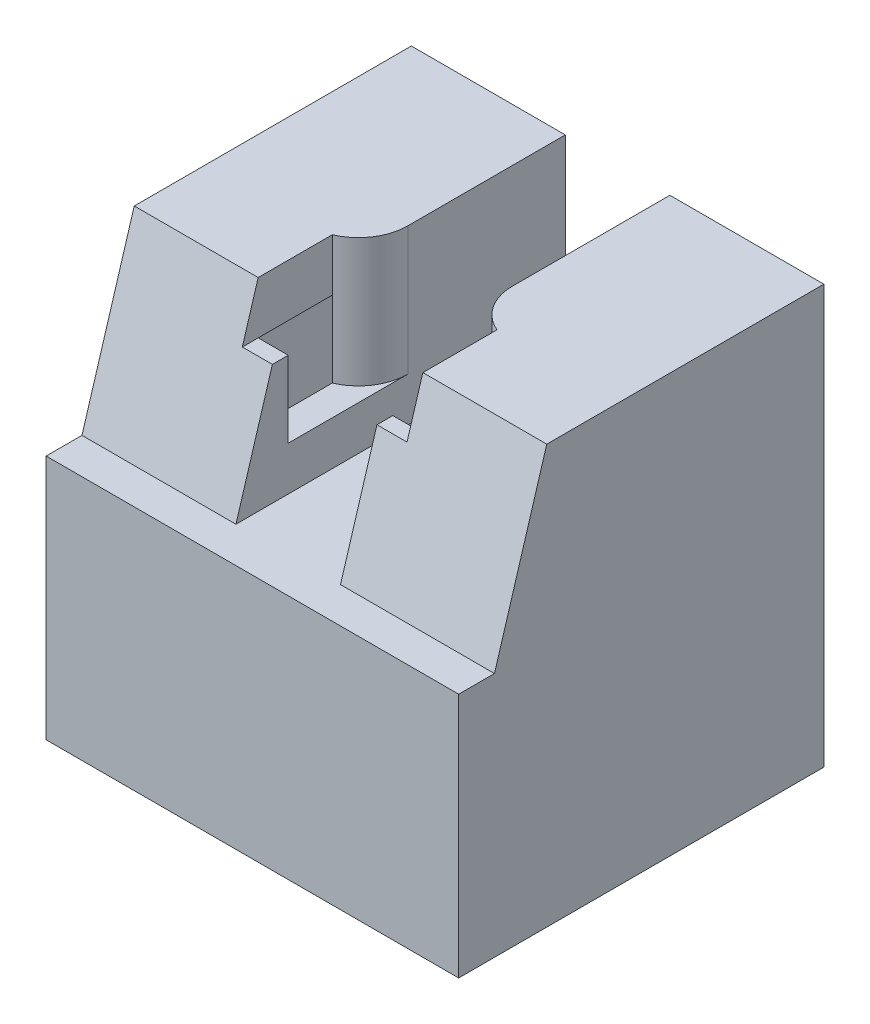
ISO-10303-21;
HEADER;
FILE_DESCRIPTION(('STEP AP214'),'2;1');
FILE_NAME('part.step','',(''),(''),'','','');
FILE_SCHEMA(('AUTOMOTIVE_DESIGN { 1 0 10303 214 1 1 1 1 }'));
ENDSEC;
DATA;
#1=APPLICATION_CONTEXT('core data for automotive mechanical design processes');
#2=APPLICATION_PROTOCOL_DEFINITION('international standard','automotive_design',2000,#1);
#3=PRODUCT_CONTEXT('',#1,'mechanical');
#4=PRODUCT('Part','Part','',(#3));
#5=PRODUCT_RELATED_PRODUCT_CATEGORY('part','',(#4));
#6=PRODUCT_DEFINITION_FORMATION('','',#4);
#7=PRODUCT_DEFINITION_CONTEXT('part definition',#1,'design');
#8=PRODUCT_DEFINITION('design','',#6,#7);
#9=PRODUCT_DEFINITION_SHAPE('','',#8);
#10=(LENGTH_UNIT() NAMED_UNIT(*) SI_UNIT(.MILLI.,.METRE.));
#11=(NAMED_UNIT(*) PLANE_ANGLE_UNIT() SI_UNIT($,.RADIAN.));
#12=(NAMED_UNIT(*) SI_UNIT($,.STERADIAN.) SOLID_ANGLE_UNIT());
#13=UNCERTAINTY_MEASURE_WITH_UNIT(LENGTH_MEASURE(1.E-05),#10,'distance_accuracy_value','');
#14=(GEOMETRIC_REPRESENTATION_CONTEXT(3) GLOBAL_UNCERTAINTY_ASSIGNED_CONTEXT((#13)) GLOBAL_UNIT_ASSIGNED_CONTEXT((#10,
#11,#12)) REPRESENTATION_CONTEXT('',''));
#15=CARTESIAN_POINT('',(0.,0.,0.));
#16=DIRECTION('',(0.,0.,1.));
#17=DIRECTION('',(1.,0.,0.));
#18=AXIS2_PLACEMENT_3D('',#15,#16,#17);
#19=CARTESIAN_POINT('',(-3.175,0.,10.));
#20=DIRECTION('',(1.,0.,0.));
#21=DIRECTION('',(0.,1.,0.));
#22=AXIS2_PLACEMENT_3D('',#19,#20,#21);
#23=PLANE('',#22);
#24=DIRECTION('',(0.,0.,-1.));
#25=VECTOR('',#24,1.);
#26=CARTESIAN_POINT('',(-3.175,25.4,10.));
#27=LINE('',#26,#25);
#28=CARTESIAN_POINT('',(-3.175,25.4,-0.435321539241397));
#29=VERTEX_POINT('',#28);
#30=CARTESIAN_POINT('',(-3.175,25.4,-10.));
#31=VERTEX_POINT('',#30);
#32=EDGE_CURVE('E431',#29,#31,#27,.T.);
#33=ORIENTED_EDGE('',*,*,#32,.F.);
#34=DIRECTION('',(0.,-1.,0.));
#35=VECTOR('',#34,1.);
#36=CARTESIAN_POINT('',(-3.175,17.6,-0.435321539241397));
#37=LINE('',#36,#35);
#38=CARTESIAN_POINT('',(-3.175,17.6,-0.435321539241397));
#39=VERTEX_POINT('',#38);
#40=EDGE_CURVE('E457',#29,#39,#37,.T.);
#41=ORIENTED_EDGE('',*,*,#40,.T.);
#42=DIRECTION('',(0.,0.,-1.));
#43=VECTOR('',#42,1.);
#44=CARTESIAN_POINT('',(-3.175,17.6,14.8356569643195));
#45=LINE('',#44,#43);
#46=CARTESIAN_POINT('',(-3.175,17.6,6.825));
#47=VERTEX_POINT('',#46);
#48=EDGE_CURVE('E47',#47,#39,#45,.T.);
#49=ORIENTED_EDGE('',*,*,#48,.F.);
#50=DIRECTION('',(0.,1.,0.));
#51=VECTOR('',#50,1.);
#52=CARTESIAN_POINT('',(-3.175,25.4,6.825));
#53=LINE('',#52,#51);
#54=CARTESIAN_POINT('',(-3.175,22.225,6.825));
#55=VERTEX_POINT('',#54);
#56=EDGE_CURVE('E282',#47,#55,#53,.T.);
#57=ORIENTED_EDGE('',*,*,#56,.T.);
#58=DIRECTION('',(0.,0.,1.));
#59=VECTOR('',#58,1.);
#60=CARTESIAN_POINT('',(-3.175,22.225,10.));
#61=LINE('',#60,#59);
#62=CARTESIAN_POINT('',(-3.175,22.225,7.7873508353222));
#63=VERTEX_POINT('',#62);
#64=EDGE_CURVE('E560',#55,#63,#61,.T.);
#65=ORIENTED_EDGE('',*,*,#64,.T.);
#66=DIRECTION('',(0.,-0.957005192729791,0.290070786340534));
#67=VECTOR('',#66,1.);
#68=CARTESIAN_POINT('',(-3.175,1.25580533674162,14.1431687881475));
#69=LINE('',#68,#67);
#70=CARTESIAN_POINT('',(-3.175,14.925,10.));
#71=VERTEX_POINT('',#70);
#72=EDGE_CURVE('E567',#63,#71,#69,.T.);
#73=ORIENTED_EDGE('',*,*,#72,.T.);
#74=DIRECTION('',(0.,0.,-1.));
#75=VECTOR('',#74,1.);
#76=CARTESIAN_POINT('',(-3.175,14.925,10.));
#77=LINE('',#76,#75);
#78=CARTESIAN_POINT('',(-3.175,14.925,-10.));
#79=VERTEX_POINT('',#78);
#80=EDGE_CURVE('E432',#71,#79,#77,.T.);
#81=ORIENTED_EDGE('',*,*,#80,.T.);
#82=DIRECTION('',(0.,-1.,0.));
#83=VECTOR('',#82,1.);
#84=CARTESIAN_POINT('',(-3.175,0.,-10.));
#85=LINE('',#84,#83);
#86=EDGE_CURVE('E421',#31,#79,#85,.T.);
#87=ORIENTED_EDGE('',*,*,#86,.F.);
#88=EDGE_LOOP('',(#33,#41,#49,#57,#65,#73,#81,#87));
#89=FACE_BOUND('',#88,.T.);
#90=ADVANCED_FACE('F33',(#89),#23,.T.);
#91=CARTESIAN_POINT('',(3.175,0.,10.));
#92=DIRECTION('',(1.,0.,0.));
#93=DIRECTION('',(0.,1.,0.));
#94=AXIS2_PLACEMENT_3D('',#91,#92,#93);
#95=PLANE('',#94);
#96=DIRECTION('',(0.,0.,-1.));
#97=VECTOR('',#96,1.);
#98=CARTESIAN_POINT('',(3.175,17.6,14.8356569643195));
#99=LINE('',#98,#97);
#100=CARTESIAN_POINT('',(3.175,17.6,6.825));
#101=VERTEX_POINT('',#100);
#102=CARTESIAN_POINT('',(3.175,17.6,-0.435321539241397));
#103=VERTEX_POINT('',#102);
#104=EDGE_CURVE('E270',#101,#103,#99,.T.);
#105=ORIENTED_EDGE('',*,*,#104,.T.);
#106=DIRECTION('',(0.,-1.,0.));
#107=VECTOR('',#106,1.);
#108=CARTESIAN_POINT('',(3.175,0.,-0.435321539241397));
#109=LINE('',#108,#107);
#110=CARTESIAN_POINT('',(3.175,25.4,-0.435321539241397));
#111=VERTEX_POINT('',#110);
#112=EDGE_CURVE('E253',#103,#111,#109,.F.);
#113=ORIENTED_EDGE('',*,*,#112,.T.);
#114=DIRECTION('',(0.,0.,-1.));
#115=VECTOR('',#114,1.);
#116=CARTESIAN_POINT('',(3.175,25.4,10.));
#117=LINE('',#116,#115);
#118=CARTESIAN_POINT('',(3.175,25.4,-10.));
#119=VERTEX_POINT('',#118);
#120=EDGE_CURVE('E437',#111,#119,#117,.T.);
#121=ORIENTED_EDGE('',*,*,#120,.T.);
#122=DIRECTION('',(0.,-1.,0.));
#123=VECTOR('',#122,1.);
#124=CARTESIAN_POINT('',(3.175,0.,-10.));
#125=LINE('',#124,#123);
#126=CARTESIAN_POINT('',(3.175,14.925,-10.));
#127=VERTEX_POINT('',#126);
#128=EDGE_CURVE('E425',#119,#127,#125,.T.);
#129=ORIENTED_EDGE('',*,*,#128,.T.);
#130=DIRECTION('',(0.,0.,-1.));
#131=VECTOR('',#130,1.);
#132=CARTESIAN_POINT('',(3.175,14.925,10.));
#133=LINE('',#132,#131);
#134=CARTESIAN_POINT('',(3.175,14.925,10.));
#135=VERTEX_POINT('',#134);
#136=EDGE_CURVE('E435',#135,#127,#133,.T.);
#137=ORIENTED_EDGE('',*,*,#136,.F.);
#138=DIRECTION('',(0.,-0.957005192729791,0.290070786340534));
#139=VECTOR('',#138,1.);
#140=CARTESIAN_POINT('',(3.175,1.25580533674162,14.1431687881475));
#141=LINE('',#140,#139);
#142=CARTESIAN_POINT('',(3.175,22.225,7.7873508353222));
#143=VERTEX_POINT('',#142);
#144=EDGE_CURVE('E556',#143,#135,#141,.T.);
#145=ORIENTED_EDGE('',*,*,#144,.F.);
#146=DIRECTION('',(0.,0.,1.));
#147=VECTOR('',#146,1.);
#148=CARTESIAN_POINT('',(3.175,22.225,10.));
#149=LINE('',#148,#147);
#150=CARTESIAN_POINT('',(3.175,22.225,6.825));
#151=VERTEX_POINT('',#150);
#152=EDGE_CURVE('E588',#151,#143,#149,.T.);
#153=ORIENTED_EDGE('',*,*,#152,.F.);
#154=DIRECTION('',(0.,-1.,0.));
#155=VECTOR('',#154,1.);
#156=CARTESIAN_POINT('',(3.175,25.4,6.825));
#157=LINE('',#156,#155);
#158=EDGE_CURVE('E269',#151,#101,#157,.T.);
#159=ORIENTED_EDGE('',*,*,#158,.T.);
#160=EDGE_LOOP('',(#105,#113,#121,#129,#137,#145,#153,#159));
#161=FACE_BOUND('',#160,.T.);
#162=ADVANCED_FACE('F472',(#161),#95,.F.);
#163=CARTESIAN_POINT('',(0.,0.,6.825));
#164=DIRECTION('',(0.,0.,-1.));
#165=DIRECTION('',(-1.,0.,0.));
#166=AXIS2_PLACEMENT_3D('',#163,#164,#165);
#167=PLANE('',#166);
#168=DIRECTION('',(1.,0.,0.));
#169=VECTOR('',#168,1.);
#170=CARTESIAN_POINT('',(0.,22.225,6.825));
#171=LINE('',#170,#169);
#172=CARTESIAN_POINT('',(-9.35,22.225,6.825));
#173=VERTEX_POINT('',#172);
#174=CARTESIAN_POINT('',(-5.,22.225,6.825));
#175=VERTEX_POINT('',#174);
#176=EDGE_CURVE('E369',#173,#175,#171,.T.);
#177=ORIENTED_EDGE('',*,*,#176,.T.);
#178=DIRECTION('',(-1.,0.,0.));
#179=VECTOR('',#178,1.);
#180=CARTESIAN_POINT('',(8.31764135045447,22.225,6.825));
#181=LINE('',#180,#179);
#182=EDGE_CURVE('E596',#55,#175,#181,.T.);
#183=ORIENTED_EDGE('',*,*,#182,.F.);
#184=ORIENTED_EDGE('',*,*,#56,.F.);
#185=DIRECTION('',(1.,0.,0.));
#186=VECTOR('',#185,1.);
#187=CARTESIAN_POINT('',(-3.175,17.6,6.825));
#188=LINE('',#187,#186);
#189=CARTESIAN_POINT('',(-5.,17.6,6.825));
#190=VERTEX_POINT('',#189);
#191=EDGE_CURVE('E285',#190,#47,#188,.T.);
#192=ORIENTED_EDGE('',*,*,#191,.F.);
#193=DIRECTION('',(0.,1.,0.));
#194=VECTOR('',#193,1.);
#195=CARTESIAN_POINT('',(-5.,0.,6.825));
#196=LINE('',#195,#194);
#197=CARTESIAN_POINT('',(-5.,10.125,6.825));
#198=VERTEX_POINT('',#197);
#199=EDGE_CURVE('E355',#198,#190,#196,.T.);
#200=ORIENTED_EDGE('',*,*,#199,.F.);
#201=DIRECTION('',(1.,0.,0.));
#202=VECTOR('',#201,1.);
#203=CARTESIAN_POINT('',(0.,10.125,6.825));
#204=LINE('',#203,#202);
#205=CARTESIAN_POINT('',(-9.35,10.125,6.825));
#206=VERTEX_POINT('',#205);
#207=EDGE_CURVE('E449',#206,#198,#204,.T.);
#208=ORIENTED_EDGE('',*,*,#207,.F.);
#209=DIRECTION('',(0.,1.,0.));
#210=VECTOR('',#209,1.);
#211=CARTESIAN_POINT('',(-9.35,0.,6.825));
#212=LINE('',#211,#210);
#213=EDGE_CURVE('E367',#206,#173,#212,.T.);
#214=ORIENTED_EDGE('',*,*,#213,.T.);
#215=EDGE_LOOP('',(#177,#183,#184,#192,#200,#208,#214));
#216=FACE_BOUND('',#215,.T.);
#217=ADVANCED_FACE('F552',(#216),#167,.T.);
#218=ORIENTED_EDGE('',*,*,#158,.F.);
#219=CARTESIAN_POINT('',(5.,22.225,6.825));
#220=VERTEX_POINT('',#219);
#221=EDGE_CURVE('E526',#220,#151,#181,.T.);
#222=ORIENTED_EDGE('',*,*,#221,.F.);
#223=DIRECTION('',(-1.,0.,0.));
#224=VECTOR('',#223,1.);
#225=CARTESIAN_POINT('',(0.,22.225,6.825));
#226=LINE('',#225,#224);
#227=CARTESIAN_POINT('',(9.35,22.225,6.825));
#228=VERTEX_POINT('',#227);
#229=EDGE_CURVE('E361',#228,#220,#226,.T.);
#230=ORIENTED_EDGE('',*,*,#229,.F.);
#231=DIRECTION('',(0.,-1.,0.));
#232=VECTOR('',#231,1.);
#233=CARTESIAN_POINT('',(9.35,0.,6.825));
#234=LINE('',#233,#232);
#235=CARTESIAN_POINT('',(9.35,10.125,6.825));
#236=VERTEX_POINT('',#235);
#237=EDGE_CURVE('E364',#228,#236,#234,.T.);
#238=ORIENTED_EDGE('',*,*,#237,.T.);
#239=CARTESIAN_POINT('',(5.,10.125,6.825));
#240=VERTEX_POINT('',#239);
#241=EDGE_CURVE('E443',#240,#236,#204,.T.);
#242=ORIENTED_EDGE('',*,*,#241,.F.);
#243=DIRECTION('',(0.,-1.,0.));
#244=VECTOR('',#243,1.);
#245=CARTESIAN_POINT('',(5.,0.,6.825));
#246=LINE('',#245,#244);
#247=CARTESIAN_POINT('',(5.,17.6,6.825));
#248=VERTEX_POINT('',#247);
#249=EDGE_CURVE('E358',#248,#240,#246,.T.);
#250=ORIENTED_EDGE('',*,*,#249,.F.);
#251=DIRECTION('',(1.,0.,0.));
#252=VECTOR('',#251,1.);
#253=CARTESIAN_POINT('',(5.,17.6,6.825));
#254=LINE('',#253,#252);
#255=EDGE_CURVE('E272',#101,#248,#254,.T.);
#256=ORIENTED_EDGE('',*,*,#255,.F.);
#257=EDGE_LOOP('',(#218,#222,#230,#238,#242,#250,#256));
#258=FACE_BOUND('',#257,.T.);
#259=ADVANCED_FACE('F523',(#258),#167,.T.);
#260=CARTESIAN_POINT('',(-12.525,4.03179782461266,13.3017581772654));
#261=DIRECTION('',(0.,0.290070786340533,0.957005192729791));
#262=DIRECTION('',(0.,-0.957005192729791,0.290070786340534));
#263=AXIS2_PLACEMENT_3D('',#260,#261,#262);
#264=PLANE('',#263);
#265=DIRECTION('',(0.,0.957005192729791,-0.290070786340534));
#266=VECTOR('',#265,1.);
#267=CARTESIAN_POINT('',(5.,4.03179782461266,13.3017581772654));
#268=LINE('',#267,#266);
#269=CARTESIAN_POINT('',(5.,22.225,7.7873508353222));
#270=VERTEX_POINT('',#269);
#271=CARTESIAN_POINT('',(5.,25.4,6.825));
#272=VERTEX_POINT('',#271);
#273=EDGE_CURVE('E242',#270,#272,#268,.T.);
#274=ORIENTED_EDGE('',*,*,#273,.F.);
#275=DIRECTION('',(-1.,0.,0.));
#276=VECTOR('',#275,1.);
#277=CARTESIAN_POINT('',(8.31764135045447,22.225,7.7873508353222));
#278=LINE('',#277,#276);
#279=EDGE_CURVE('E595',#270,#143,#278,.T.);
#280=ORIENTED_EDGE('',*,*,#279,.T.);
#281=ORIENTED_EDGE('',*,*,#144,.T.);
#282=DIRECTION('',(1.,0.,0.));
#283=VECTOR('',#282,1.);
#284=CARTESIAN_POINT('',(-27.6076473140493,14.925,10.));
#285=LINE('',#284,#283);
#286=CARTESIAN_POINT('',(12.525,14.925,10.));
#287=VERTEX_POINT('',#286);
#288=EDGE_CURVE('E318',#135,#287,#285,.T.);
#289=ORIENTED_EDGE('',*,*,#288,.T.);
#290=DIRECTION('',(0.,-0.957005192729791,0.290070786340534));
#291=VECTOR('',#290,1.);
#292=CARTESIAN_POINT('',(12.525,4.03179782461266,13.3017581772654));
#293=LINE('',#292,#291);
#294=CARTESIAN_POINT('',(12.525,25.4,6.825));
#295=VERTEX_POINT('',#294);
#296=EDGE_CURVE('E260',#295,#287,#293,.T.);
#297=ORIENTED_EDGE('',*,*,#296,.F.);
#298=DIRECTION('',(1.,0.,0.));
#299=VECTOR('',#298,1.);
#300=CARTESIAN_POINT('',(-12.525,25.4,6.825));
#301=LINE('',#300,#299);
#302=EDGE_CURVE('E257',#272,#295,#301,.T.);
#303=ORIENTED_EDGE('',*,*,#302,.F.);
#304=EDGE_LOOP('',(#274,#280,#281,#289,#297,#303));
#305=FACE_BOUND('',#304,.T.);
#306=ADVANCED_FACE('F258',(#305),#264,.T.);
#307=ORIENTED_EDGE('',*,*,#72,.F.);
#308=DIRECTION('',(-1.,0.,0.));
#309=VECTOR('',#308,1.);
#310=CARTESIAN_POINT('',(-12.525,22.225,7.7873508353222));
#311=LINE('',#310,#309);
#312=CARTESIAN_POINT('',(-5.,22.225,7.7873508353222));
#313=VERTEX_POINT('',#312);
#314=EDGE_CURVE('E254',#63,#313,#311,.T.);
#315=ORIENTED_EDGE('',*,*,#314,.T.);
#316=DIRECTION('',(0.,-0.957005192729791,0.290070786340534));
#317=VECTOR('',#316,1.);
#318=CARTESIAN_POINT('',(-5.,4.03179782461266,13.3017581772654));
#319=LINE('',#318,#317);
#320=CARTESIAN_POINT('',(-5.,25.4,6.825));
#321=VERTEX_POINT('',#320);
#322=EDGE_CURVE('E450',#321,#313,#319,.T.);
#323=ORIENTED_EDGE('',*,*,#322,.F.);
#324=CARTESIAN_POINT('',(-12.525,25.4,6.825));
#325=VERTEX_POINT('',#324);
#326=EDGE_CURVE('E263',#325,#321,#301,.T.);
#327=ORIENTED_EDGE('',*,*,#326,.F.);
#328=DIRECTION('',(0.,-0.957005192729791,0.290070786340534));
#329=VECTOR('',#328,1.);
#330=CARTESIAN_POINT('',(-12.525,4.03179782461266,13.3017581772654));
#331=LINE('',#330,#329);
#332=CARTESIAN_POINT('',(-12.525,14.925,10.));
#333=VERTEX_POINT('',#332);
#334=EDGE_CURVE('E264',#325,#333,#331,.T.);
#335=ORIENTED_EDGE('',*,*,#334,.T.);
#336=EDGE_CURVE('E313',#333,#71,#285,.T.);
#337=ORIENTED_EDGE('',*,*,#336,.T.);
#338=EDGE_LOOP('',(#307,#315,#323,#327,#335,#337));
#339=FACE_BOUND('',#338,.T.);
#340=ADVANCED_FACE('F566',(#339),#264,.T.);
#341=CARTESIAN_POINT('',(0.,25.4,0.));
#342=DIRECTION('',(0.,1.,0.));
#343=DIRECTION('',(0.,0.,1.));
#344=AXIS2_PLACEMENT_3D('',#341,#342,#343);
#345=PLANE('',#344);
#346=DIRECTION('',(0.,0.,-1.));
#347=VECTOR('',#346,1.);
#348=CARTESIAN_POINT('',(-5.,25.4,14.8356569643195));
#349=LINE('',#348,#347);
#350=CARTESIAN_POINT('',(-5.,25.4,2.325));
#351=VERTEX_POINT('',#350);
#352=EDGE_CURVE('E286',#321,#351,#349,.T.);
#353=ORIENTED_EDGE('',*,*,#352,.T.);
#354=CARTESIAN_POINT('',(-6.17500000000001,25.4,-0.435321539241397));
#355=DIRECTION('',(0.,1.,0.));
#356=DIRECTION('',(0.,0.,1.));
#357=AXIS2_PLACEMENT_3D('',#354,#355,#356);
#358=CIRCLE('',#357,3.);
#359=EDGE_CURVE('E55',#351,#29,#358,.T.);
#360=ORIENTED_EDGE('',*,*,#359,.T.);
#361=ORIENTED_EDGE('',*,*,#32,.T.);
#362=DIRECTION('',(-1.,0.,0.));
#363=VECTOR('',#362,1.);
#364=CARTESIAN_POINT('',(-9.35,25.4,-10.));
#365=LINE('',#364,#363);
#366=CARTESIAN_POINT('',(-12.525,25.4,-10.));
#367=VERTEX_POINT('',#366);
#368=EDGE_CURVE('E444',#31,#367,#365,.T.);
#369=ORIENTED_EDGE('',*,*,#368,.T.);
#370=DIRECTION('',(0.,0.,-1.));
#371=VECTOR('',#370,1.);
#372=CARTESIAN_POINT('',(-12.525,25.4,35.5976683508479));
#373=LINE('',#372,#371);
#374=EDGE_CURVE('E410',#325,#367,#373,.T.);
#375=ORIENTED_EDGE('',*,*,#374,.F.);
#376=ORIENTED_EDGE('',*,*,#326,.T.);
#377=EDGE_LOOP('',(#353,#360,#361,#369,#375,#376));
#378=FACE_BOUND('',#377,.T.);
#379=ADVANCED_FACE('F583',(#378),#345,.T.);
#380=ORIENTED_EDGE('',*,*,#120,.F.);
#381=CARTESIAN_POINT('',(6.17500000000001,25.4,-0.435321539241397));
#382=DIRECTION('',(0.,1.,0.));
#383=DIRECTION('',(0.,0.,1.));
#384=AXIS2_PLACEMENT_3D('',#381,#382,#383);
#385=CIRCLE('',#384,3.);
#386=CARTESIAN_POINT('',(5.,25.4,2.325));
#387=VERTEX_POINT('',#386);
#388=EDGE_CURVE('E268',#111,#387,#385,.T.);
#389=ORIENTED_EDGE('',*,*,#388,.T.);
#390=DIRECTION('',(0.,0.,-1.));
#391=VECTOR('',#390,1.);
#392=CARTESIAN_POINT('',(5.,25.4,14.8356569643195));
#393=LINE('',#392,#391);
#394=EDGE_CURVE('E247',#272,#387,#393,.T.);
#395=ORIENTED_EDGE('',*,*,#394,.F.);
#396=ORIENTED_EDGE('',*,*,#302,.T.);
#397=DIRECTION('',(0.,0.,-1.));
#398=VECTOR('',#397,1.);
#399=CARTESIAN_POINT('',(12.525,25.4,35.5976683508479));
#400=LINE('',#399,#398);
#401=CARTESIAN_POINT('',(12.525,25.4,-10.));
#402=VERTEX_POINT('',#401);
#403=EDGE_CURVE('E417',#295,#402,#400,.T.);
#404=ORIENTED_EDGE('',*,*,#403,.T.);
#405=EDGE_CURVE('E440',#402,#119,#365,.T.);
#406=ORIENTED_EDGE('',*,*,#405,.T.);
#407=EDGE_LOOP('',(#380,#389,#395,#396,#404,#406));
#408=FACE_BOUND('',#407,.T.);
#409=ADVANCED_FACE('F267',(#408),#345,.T.);
#410=CARTESIAN_POINT('',(12.525,25.4,35.5976683508479));
#411=DIRECTION('',(1.,0.,0.));
#412=DIRECTION('',(0.,1.,0.));
#413=AXIS2_PLACEMENT_3D('',#410,#411,#412);
#414=PLANE('',#413);
#415=ORIENTED_EDGE('',*,*,#403,.F.);
#416=ORIENTED_EDGE('',*,*,#296,.T.);
#417=DIRECTION('',(0.,0.,1.));
#418=VECTOR('',#417,1.);
#419=CARTESIAN_POINT('',(12.525,14.925,10.));
#420=LINE('',#419,#418);
#421=CARTESIAN_POINT('',(12.525,14.925,12.175));
#422=VERTEX_POINT('',#421);
#423=EDGE_CURVE('E281',#287,#422,#420,.T.);
#424=ORIENTED_EDGE('',*,*,#423,.T.);
#425=DIRECTION('',(0.,-1.,0.));
#426=VECTOR('',#425,1.);
#427=CARTESIAN_POINT('',(12.525,14.925,12.175));
#428=LINE('',#427,#426);
#429=CARTESIAN_POINT('',(12.525,0.,12.175));
#430=VERTEX_POINT('',#429);
#431=EDGE_CURVE('E298',#422,#430,#428,.T.);
#432=ORIENTED_EDGE('',*,*,#431,.T.);
#433=DIRECTION('',(0.,0.,-1.));
#434=VECTOR('',#433,1.);
#435=CARTESIAN_POINT('',(12.525,0.,35.5976683508479));
#436=LINE('',#435,#434);
#437=CARTESIAN_POINT('',(12.525,0.,-10.));
#438=VERTEX_POINT('',#437);
#439=EDGE_CURVE('E418',#430,#438,#436,.T.);
#440=ORIENTED_EDGE('',*,*,#439,.T.);
#441=DIRECTION('',(0.,-1.,0.));
#442=VECTOR('',#441,1.);
#443=CARTESIAN_POINT('',(12.525,25.4,-10.));
#444=LINE('',#443,#442);
#445=EDGE_CURVE('E412',#402,#438,#444,.T.);
#446=ORIENTED_EDGE('',*,*,#445,.F.);
#447=EDGE_LOOP('',(#415,#416,#424,#432,#440,#446));
#448=FACE_BOUND('',#447,.T.);
#449=ADVANCED_FACE('F480',(#448),#414,.T.);
#450=CARTESIAN_POINT('',(-12.525,25.4,35.5976683508479));
#451=DIRECTION('',(-1.,0.,0.));
#452=DIRECTION('',(0.,-1.,0.));
#453=AXIS2_PLACEMENT_3D('',#450,#451,#452);
#454=PLANE('',#453);
#455=DIRECTION('',(0.,0.,1.));
#456=VECTOR('',#455,1.);
#457=CARTESIAN_POINT('',(-12.525,14.925,10.));
#458=LINE('',#457,#456);
#459=CARTESIAN_POINT('',(-12.525,14.925,12.175));
#460=VERTEX_POINT('',#459);
#461=EDGE_CURVE('E301',#333,#460,#458,.T.);
#462=ORIENTED_EDGE('',*,*,#461,.F.);
#463=ORIENTED_EDGE('',*,*,#334,.F.);
#464=ORIENTED_EDGE('',*,*,#374,.T.);
#465=DIRECTION('',(0.,1.,0.));
#466=VECTOR('',#465,1.);
#467=CARTESIAN_POINT('',(-12.525,25.4,-10.));
#468=LINE('',#467,#466);
#469=CARTESIAN_POINT('',(-12.525,0.,-10.));
#470=VERTEX_POINT('',#469);
#471=EDGE_CURVE('E393',#470,#367,#468,.T.);
#472=ORIENTED_EDGE('',*,*,#471,.F.);
#473=DIRECTION('',(0.,0.,-1.));
#474=VECTOR('',#473,1.);
#475=CARTESIAN_POINT('',(-12.525,0.,35.5976683508479));
#476=LINE('',#475,#474);
#477=CARTESIAN_POINT('',(-12.525,0.,12.175));
#478=VERTEX_POINT('',#477);
#479=EDGE_CURVE('E409',#478,#470,#476,.T.);
#480=ORIENTED_EDGE('',*,*,#479,.F.);
#481=DIRECTION('',(0.,-1.,0.));
#482=VECTOR('',#481,1.);
#483=CARTESIAN_POINT('',(-12.525,14.925,12.175));
#484=LINE('',#483,#482);
#485=EDGE_CURVE('E307',#460,#478,#484,.T.);
#486=ORIENTED_EDGE('',*,*,#485,.F.);
#487=EDGE_LOOP('',(#462,#463,#464,#472,#480,#486));
#488=FACE_BOUND('',#487,.T.);
#489=ADVANCED_FACE('F491',(#488),#454,.T.);
#490=CARTESIAN_POINT('',(-9.35,25.4,-10.));
#491=DIRECTION('',(0.,0.,1.));
#492=DIRECTION('',(1.,0.,0.));
#493=AXIS2_PLACEMENT_3D('',#490,#491,#492);
#494=PLANE('',#493);
#495=DIRECTION('',(-1.,0.,0.));
#496=VECTOR('',#495,1.);
#497=CARTESIAN_POINT('',(-9.35,0.,-10.));
#498=LINE('',#497,#496);
#499=CARTESIAN_POINT('',(11.,0.,-10.));
#500=VERTEX_POINT('',#499);
#501=EDGE_CURVE('E445',#438,#500,#498,.T.);
#502=ORIENTED_EDGE('',*,*,#501,.T.);
#503=DIRECTION('',(0.,-1.,0.));
#504=VECTOR('',#503,1.);
#505=CARTESIAN_POINT('',(11.,10.125,-10.));
#506=LINE('',#505,#504);
#507=CARTESIAN_POINT('',(11.,10.125,-10.));
#508=VERTEX_POINT('',#507);
#509=EDGE_CURVE('E317',#508,#500,#506,.T.);
#510=ORIENTED_EDGE('',*,*,#509,.F.);
#511=DIRECTION('',(1.,0.,0.));
#512=VECTOR('',#511,1.);
#513=CARTESIAN_POINT('',(11.,10.125,-10.));
#514=LINE('',#513,#512);
#515=CARTESIAN_POINT('',(9.35,10.125,-10.));
#516=VERTEX_POINT('',#515);
#517=EDGE_CURVE('E337',#516,#508,#514,.T.);
#518=ORIENTED_EDGE('',*,*,#517,.F.);
#519=DIRECTION('',(0.,-1.,0.));
#520=VECTOR('',#519,1.);
#521=CARTESIAN_POINT('',(9.35,0.,-10.));
#522=LINE('',#521,#520);
#523=CARTESIAN_POINT('',(9.35,22.225,-10.));
#524=VERTEX_POINT('',#523);
#525=EDGE_CURVE('E384',#524,#516,#522,.T.);
#526=ORIENTED_EDGE('',*,*,#525,.F.);
#527=DIRECTION('',(-1.,0.,0.));
#528=VECTOR('',#527,1.);
#529=CARTESIAN_POINT('',(0.,22.225,-10.));
#530=LINE('',#529,#528);
#531=CARTESIAN_POINT('',(5.,22.225,-10.));
#532=VERTEX_POINT('',#531);
#533=EDGE_CURVE('E381',#524,#532,#530,.T.);
#534=ORIENTED_EDGE('',*,*,#533,.T.);
#535=DIRECTION('',(0.,-1.,0.));
#536=VECTOR('',#535,1.);
#537=CARTESIAN_POINT('',(5.,0.,-10.));
#538=LINE('',#537,#536);
#539=CARTESIAN_POINT('',(5.,10.125,-10.));
#540=VERTEX_POINT('',#539);
#541=EDGE_CURVE('E378',#532,#540,#538,.T.);
#542=ORIENTED_EDGE('',*,*,#541,.T.);
#543=DIRECTION('',(-1.,0.,0.));
#544=VECTOR('',#543,1.);
#545=CARTESIAN_POINT('',(0.,10.125,-10.));
#546=LINE('',#545,#544);
#547=CARTESIAN_POINT('',(-5.,10.125,-10.));
#548=VERTEX_POINT('',#547);
#549=EDGE_CURVE('E375',#540,#548,#546,.T.);
#550=ORIENTED_EDGE('',*,*,#549,.T.);
#551=DIRECTION('',(0.,1.,0.));
#552=VECTOR('',#551,1.);
#553=CARTESIAN_POINT('',(-5.,0.,-10.));
#554=LINE('',#553,#552);
#555=CARTESIAN_POINT('',(-5.,22.225,-10.));
#556=VERTEX_POINT('',#555);
#557=EDGE_CURVE('E354',#548,#556,#554,.T.);
#558=ORIENTED_EDGE('',*,*,#557,.T.);
#559=DIRECTION('',(1.,0.,0.));
#560=VECTOR('',#559,1.);
#561=CARTESIAN_POINT('',(0.,22.225,-10.));
#562=LINE('',#561,#560);
#563=CARTESIAN_POINT('',(-9.35,22.225,-10.));
#564=VERTEX_POINT('',#563);
#565=EDGE_CURVE('E359',#564,#556,#562,.T.);
#566=ORIENTED_EDGE('',*,*,#565,.F.);
#567=DIRECTION('',(0.,1.,0.));
#568=VECTOR('',#567,1.);
#569=CARTESIAN_POINT('',(-9.35,0.,-10.));
#570=LINE('',#569,#568);
#571=CARTESIAN_POINT('',(-9.35,10.125,-10.));
#572=VERTEX_POINT('',#571);
#573=EDGE_CURVE('E387',#572,#564,#570,.T.);
#574=ORIENTED_EDGE('',*,*,#573,.F.);
#575=CARTESIAN_POINT('',(-11.,10.125,-10.));
#576=VERTEX_POINT('',#575);
#577=EDGE_CURVE('E323',#576,#572,#514,.T.);
#578=ORIENTED_EDGE('',*,*,#577,.F.);
#579=DIRECTION('',(0.,1.,0.));
#580=VECTOR('',#579,1.);
#581=CARTESIAN_POINT('',(-11.,10.125,-10.));
#582=LINE('',#581,#580);
#583=CARTESIAN_POINT('',(-11.,0.,-10.));
#584=VERTEX_POINT('',#583);
#585=EDGE_CURVE('E334',#584,#576,#582,.T.);
#586=ORIENTED_EDGE('',*,*,#585,.F.);
#587=EDGE_CURVE('E434',#584,#470,#498,.T.);
#588=ORIENTED_EDGE('',*,*,#587,.T.);
#589=ORIENTED_EDGE('',*,*,#471,.T.);
#590=ORIENTED_EDGE('',*,*,#368,.F.);
#591=ORIENTED_EDGE('',*,*,#86,.T.);
#592=DIRECTION('',(-1.,0.,0.));
#593=VECTOR('',#592,1.);
#594=CARTESIAN_POINT('',(0.,14.925,-10.));
#595=LINE('',#594,#593);
#596=EDGE_CURVE('E428',#127,#79,#595,.T.);
#597=ORIENTED_EDGE('',*,*,#596,.F.);
#598=ORIENTED_EDGE('',*,*,#128,.F.);
#599=ORIENTED_EDGE('',*,*,#405,.F.);
#600=ORIENTED_EDGE('',*,*,#445,.T.);
#601=EDGE_LOOP('',(#502,#510,#518,#526,#534,#542,#550,#558,#566,#574,#578,#586,#588,#589,#590,
#591,#597,#598,#599,#600));
#602=FACE_BOUND('',#601,.T.);
#603=ADVANCED_FACE('F477',(#602),#494,.F.);
#604=CARTESIAN_POINT('',(0.,0.,0.));
#605=DIRECTION('',(0.,1.,0.));
#606=DIRECTION('',(0.,0.,1.));
#607=AXIS2_PLACEMENT_3D('',#604,#605,#606);
#608=PLANE('',#607);
#609=DIRECTION('',(-1.,0.,0.));
#610=VECTOR('',#609,1.);
#611=CARTESIAN_POINT('',(11.,0.,9.));
#612=LINE('',#611,#610);
#613=CARTESIAN_POINT('',(11.,0.,9.));
#614=VERTEX_POINT('',#613);
#615=CARTESIAN_POINT('',(-11.,0.,9.));
#616=VERTEX_POINT('',#615);
#617=EDGE_CURVE('E322',#614,#616,#612,.T.);
#618=ORIENTED_EDGE('',*,*,#617,.F.);
#619=DIRECTION('',(0.,0.,-1.));
#620=VECTOR('',#619,1.);
#621=CARTESIAN_POINT('',(11.,0.,9.));
#622=LINE('',#621,#620);
#623=EDGE_CURVE('E332',#614,#500,#622,.T.);
#624=ORIENTED_EDGE('',*,*,#623,.T.);
#625=ORIENTED_EDGE('',*,*,#501,.F.);
#626=ORIENTED_EDGE('',*,*,#439,.F.);
#627=DIRECTION('',(1.,0.,0.));
#628=VECTOR('',#627,1.);
#629=CARTESIAN_POINT('',(-27.6076473140494,0.,12.175));
#630=LINE('',#629,#628);
#631=EDGE_CURVE('E310',#478,#430,#630,.T.);
#632=ORIENTED_EDGE('',*,*,#631,.F.);
#633=ORIENTED_EDGE('',*,*,#479,.T.);
#634=ORIENTED_EDGE('',*,*,#587,.F.);
#635=DIRECTION('',(0.,0.,-1.));
#636=VECTOR('',#635,1.);
#637=CARTESIAN_POINT('',(-11.,0.,9.));
#638=LINE('',#637,#636);
#639=EDGE_CURVE('E345',#616,#584,#638,.T.);
#640=ORIENTED_EDGE('',*,*,#639,.F.);
#641=EDGE_LOOP('',(#618,#624,#625,#626,#632,#633,#634,#640));
#642=FACE_BOUND('',#641,.T.);
#643=ADVANCED_FACE('F485',(#642),#608,.F.);
#644=CARTESIAN_POINT('',(0.,14.925,10.));
#645=DIRECTION('',(0.,-1.,0.));
#646=DIRECTION('',(0.,0.,-1.));
#647=AXIS2_PLACEMENT_3D('',#644,#645,#646);
#648=PLANE('',#647);
#649=ORIENTED_EDGE('',*,*,#288,.F.);
#650=ORIENTED_EDGE('',*,*,#136,.T.);
#651=ORIENTED_EDGE('',*,*,#596,.T.);
#652=ORIENTED_EDGE('',*,*,#80,.F.);
#653=ORIENTED_EDGE('',*,*,#336,.F.);
#654=ORIENTED_EDGE('',*,*,#461,.T.);
#655=DIRECTION('',(1.,0.,0.));
#656=VECTOR('',#655,1.);
#657=CARTESIAN_POINT('',(-27.6076473140493,14.925,12.175));
#658=LINE('',#657,#656);
#659=EDGE_CURVE('E306',#460,#422,#658,.T.);
#660=ORIENTED_EDGE('',*,*,#659,.T.);
#661=ORIENTED_EDGE('',*,*,#423,.F.);
#662=EDGE_LOOP('',(#649,#650,#651,#652,#653,#654,#660,#661));
#663=FACE_BOUND('',#662,.T.);
#664=ADVANCED_FACE('F562',(#663),#648,.F.);
#665=CARTESIAN_POINT('',(-5.,0.,6.825));
#666=DIRECTION('',(-1.,0.,0.));
#667=DIRECTION('',(0.,-1.,0.));
#668=AXIS2_PLACEMENT_3D('',#665,#666,#667);
#669=PLANE('',#668);
#670=DIRECTION('',(0.,0.,-1.));
#671=VECTOR('',#670,1.);
#672=CARTESIAN_POINT('',(-5.,17.6,14.8356569643195));
#673=LINE('',#672,#671);
#674=CARTESIAN_POINT('',(-5.,17.6,2.325));
#675=VERTEX_POINT('',#674);
#676=EDGE_CURVE('E292',#190,#675,#673,.T.);
#677=ORIENTED_EDGE('',*,*,#676,.T.);
#678=DIRECTION('',(0.,1.,0.));
#679=VECTOR('',#678,1.);
#680=CARTESIAN_POINT('',(-5.,25.4,2.325));
#681=LINE('',#680,#679);
#682=CARTESIAN_POINT('',(-5.,22.225,2.325));
#683=VERTEX_POINT('',#682);
#684=EDGE_CURVE('E287',#675,#683,#681,.T.);
#685=ORIENTED_EDGE('',*,*,#684,.T.);
#686=DIRECTION('',(0.,0.,-1.));
#687=VECTOR('',#686,1.);
#688=CARTESIAN_POINT('',(-5.,22.225,6.825));
#689=LINE('',#688,#687);
#690=EDGE_CURVE('E394',#683,#556,#689,.T.);
#691=ORIENTED_EDGE('',*,*,#690,.T.);
#692=ORIENTED_EDGE('',*,*,#557,.F.);
#693=DIRECTION('',(0.,0.,-1.));
#694=VECTOR('',#693,1.);
#695=CARTESIAN_POINT('',(-5.,10.125,6.825));
#696=LINE('',#695,#694);
#697=EDGE_CURVE('E372',#198,#548,#696,.T.);
#698=ORIENTED_EDGE('',*,*,#697,.F.);
#699=ORIENTED_EDGE('',*,*,#199,.T.);
#700=EDGE_LOOP('',(#677,#685,#691,#692,#698,#699));
#701=FACE_BOUND('',#700,.T.);
#702=ADVANCED_FACE('F539',(#701),#669,.T.);
#703=CARTESIAN_POINT('',(0.,22.225,6.825));
#704=DIRECTION('',(0.,1.,0.));
#705=DIRECTION('',(0.,0.,1.));
#706=AXIS2_PLACEMENT_3D('',#703,#704,#705);
#707=PLANE('',#706);
#708=ORIENTED_EDGE('',*,*,#565,.T.);
#709=ORIENTED_EDGE('',*,*,#690,.F.);
#710=EDGE_CURVE('E391',#175,#683,#689,.T.);
#711=ORIENTED_EDGE('',*,*,#710,.F.);
#712=ORIENTED_EDGE('',*,*,#176,.F.);
#713=DIRECTION('',(0.,0.,-1.));
#714=VECTOR('',#713,1.);
#715=CARTESIAN_POINT('',(-9.35,22.225,6.825));
#716=LINE('',#715,#714);
#717=EDGE_CURVE('E395',#173,#564,#716,.T.);
#718=ORIENTED_EDGE('',*,*,#717,.T.);
#719=EDGE_LOOP('',(#708,#709,#711,#712,#718));
#720=FACE_BOUND('',#719,.T.);
#721=ADVANCED_FACE('F543',(#720),#707,.F.);
#722=CARTESIAN_POINT('',(-9.35,0.,6.825));
#723=DIRECTION('',(-1.,0.,0.));
#724=DIRECTION('',(0.,-1.,0.));
#725=AXIS2_PLACEMENT_3D('',#722,#723,#724);
#726=PLANE('',#725);
#727=ORIENTED_EDGE('',*,*,#213,.F.);
#728=DIRECTION('',(0.,0.,-1.));
#729=VECTOR('',#728,1.);
#730=CARTESIAN_POINT('',(-9.35,10.125,6.825));
#731=LINE('',#730,#729);
#732=EDGE_CURVE('E351',#206,#572,#731,.T.);
#733=ORIENTED_EDGE('',*,*,#732,.T.);
#734=ORIENTED_EDGE('',*,*,#573,.T.);
#735=ORIENTED_EDGE('',*,*,#717,.F.);
#736=EDGE_LOOP('',(#727,#733,#734,#735));
#737=FACE_BOUND('',#736,.T.);
#738=ADVANCED_FACE('F550',(#737),#726,.F.);
#739=CARTESIAN_POINT('',(9.35,0.,6.825));
#740=DIRECTION('',(1.,0.,0.));
#741=DIRECTION('',(0.,0.,-1.));
#742=AXIS2_PLACEMENT_3D('',#739,#740,#741);
#743=PLANE('',#742);
#744=ORIENTED_EDGE('',*,*,#525,.T.);
#745=DIRECTION('',(0.,0.,1.));
#746=VECTOR('',#745,1.);
#747=CARTESIAN_POINT('',(9.35,10.125,6.825));
#748=LINE('',#747,#746);
#749=EDGE_CURVE('E342',#516,#236,#748,.T.);
#750=ORIENTED_EDGE('',*,*,#749,.T.);
#751=ORIENTED_EDGE('',*,*,#237,.F.);
#752=DIRECTION('',(0.,0.,-1.));
#753=VECTOR('',#752,1.);
#754=CARTESIAN_POINT('',(9.35,22.225,6.825));
#755=LINE('',#754,#753);
#756=EDGE_CURVE('E398',#228,#524,#755,.T.);
#757=ORIENTED_EDGE('',*,*,#756,.T.);
#758=EDGE_LOOP('',(#744,#750,#751,#757));
#759=FACE_BOUND('',#758,.T.);
#760=ADVANCED_FACE('F519',(#759),#743,.F.);
#761=CARTESIAN_POINT('',(0.,22.225,6.825));
#762=DIRECTION('',(0.,-1.,0.));
#763=DIRECTION('',(0.,0.,-1.));
#764=AXIS2_PLACEMENT_3D('',#761,#762,#763);
#765=PLANE('',#764);
#766=ORIENTED_EDGE('',*,*,#533,.F.);
#767=ORIENTED_EDGE('',*,*,#756,.F.);
#768=ORIENTED_EDGE('',*,*,#229,.T.);
#769=DIRECTION('',(0.,0.,-1.));
#770=VECTOR('',#769,1.);
#771=CARTESIAN_POINT('',(5.,22.225,6.825));
#772=LINE('',#771,#770);
#773=CARTESIAN_POINT('',(5.,22.225,2.325));
#774=VERTEX_POINT('',#773);
#775=EDGE_CURVE('E400',#220,#774,#772,.T.);
#776=ORIENTED_EDGE('',*,*,#775,.T.);
#777=EDGE_CURVE('E403',#774,#532,#772,.T.);
#778=ORIENTED_EDGE('',*,*,#777,.T.);
#779=EDGE_LOOP('',(#766,#767,#768,#776,#778));
#780=FACE_BOUND('',#779,.T.);
#781=ADVANCED_FACE('F529',(#780),#765,.T.);
#782=CARTESIAN_POINT('',(5.,0.,6.825));
#783=DIRECTION('',(1.,0.,0.));
#784=DIRECTION('',(0.,1.,0.));
#785=AXIS2_PLACEMENT_3D('',#782,#783,#784);
#786=PLANE('',#785);
#787=DIRECTION('',(0.,0.,-1.));
#788=VECTOR('',#787,1.);
#789=CARTESIAN_POINT('',(5.,17.6,14.8356569643195));
#790=LINE('',#789,#788);
#791=CARTESIAN_POINT('',(5.,17.6,2.325));
#792=VERTEX_POINT('',#791);
#793=EDGE_CURVE('E274',#248,#792,#790,.T.);
#794=ORIENTED_EDGE('',*,*,#793,.F.);
#795=ORIENTED_EDGE('',*,*,#249,.T.);
#796=DIRECTION('',(0.,0.,-1.));
#797=VECTOR('',#796,1.);
#798=CARTESIAN_POINT('',(5.,10.125,6.825));
#799=LINE('',#798,#797);
#800=EDGE_CURVE('E404',#240,#540,#799,.T.);
#801=ORIENTED_EDGE('',*,*,#800,.T.);
#802=ORIENTED_EDGE('',*,*,#541,.F.);
#803=ORIENTED_EDGE('',*,*,#777,.F.);
#804=DIRECTION('',(0.,-1.,0.));
#805=VECTOR('',#804,1.);
#806=CARTESIAN_POINT('',(5.,25.4,2.325));
#807=LINE('',#806,#805);
#808=EDGE_CURVE('E297',#774,#792,#807,.T.);
#809=ORIENTED_EDGE('',*,*,#808,.T.);
#810=EDGE_LOOP('',(#794,#795,#801,#802,#803,#809));
#811=FACE_BOUND('',#810,.T.);
#812=ADVANCED_FACE('F533',(#811),#786,.T.);
#813=CARTESIAN_POINT('',(0.,10.125,6.825));
#814=DIRECTION('',(0.,-1.,0.));
#815=DIRECTION('',(0.,0.,-1.));
#816=AXIS2_PLACEMENT_3D('',#813,#814,#815);
#817=PLANE('',#816);
#818=ORIENTED_EDGE('',*,*,#549,.F.);
#819=ORIENTED_EDGE('',*,*,#800,.F.);
#820=ORIENTED_EDGE('',*,*,#241,.T.);
#821=ORIENTED_EDGE('',*,*,#749,.F.);
#822=ORIENTED_EDGE('',*,*,#517,.T.);
#823=DIRECTION('',(0.,0.,-1.));
#824=VECTOR('',#823,1.);
#825=CARTESIAN_POINT('',(11.,10.125,9.));
#826=LINE('',#825,#824);
#827=CARTESIAN_POINT('',(11.,10.125,9.));
#828=VERTEX_POINT('',#827);
#829=EDGE_CURVE('E339',#828,#508,#826,.T.);
#830=ORIENTED_EDGE('',*,*,#829,.F.);
#831=DIRECTION('',(1.,0.,0.));
#832=VECTOR('',#831,1.);
#833=CARTESIAN_POINT('',(11.,10.125,9.));
#834=LINE('',#833,#832);
#835=CARTESIAN_POINT('',(-11.,10.125,9.));
#836=VERTEX_POINT('',#835);
#837=EDGE_CURVE('E329',#836,#828,#834,.T.);
#838=ORIENTED_EDGE('',*,*,#837,.F.);
#839=DIRECTION('',(0.,0.,-1.));
#840=VECTOR('',#839,1.);
#841=CARTESIAN_POINT('',(-11.,10.125,9.));
#842=LINE('',#841,#840);
#843=EDGE_CURVE('E343',#836,#576,#842,.T.);
#844=ORIENTED_EDGE('',*,*,#843,.T.);
#845=ORIENTED_EDGE('',*,*,#577,.T.);
#846=ORIENTED_EDGE('',*,*,#732,.F.);
#847=ORIENTED_EDGE('',*,*,#207,.T.);
#848=ORIENTED_EDGE('',*,*,#697,.T.);
#849=EDGE_LOOP('',(#818,#819,#820,#821,#822,#830,#838,#844,#845,#846,#847,#848));
#850=FACE_BOUND('',#849,.T.);
#851=ADVANCED_FACE('F514',(#850),#817,.T.);
#852=CARTESIAN_POINT('',(11.,10.125,9.));
#853=DIRECTION('',(1.,0.,0.));
#854=DIRECTION('',(0.,0.,-1.));
#855=AXIS2_PLACEMENT_3D('',#852,#853,#854);
#856=PLANE('',#855);
#857=ORIENTED_EDGE('',*,*,#509,.T.);
#858=ORIENTED_EDGE('',*,*,#623,.F.);
#859=DIRECTION('',(0.,-1.,0.));
#860=VECTOR('',#859,1.);
#861=CARTESIAN_POINT('',(11.,10.125,9.));
#862=LINE('',#861,#860);
#863=EDGE_CURVE('E319',#828,#614,#862,.T.);
#864=ORIENTED_EDGE('',*,*,#863,.F.);
#865=ORIENTED_EDGE('',*,*,#829,.T.);
#866=EDGE_LOOP('',(#857,#858,#864,#865));
#867=FACE_BOUND('',#866,.T.);
#868=ADVANCED_FACE('F511',(#867),#856,.F.);
#869=CARTESIAN_POINT('',(-11.,10.125,9.));
#870=DIRECTION('',(-1.,0.,0.));
#871=DIRECTION('',(0.,-1.,0.));
#872=AXIS2_PLACEMENT_3D('',#869,#870,#871);
#873=PLANE('',#872);
#874=ORIENTED_EDGE('',*,*,#585,.T.);
#875=ORIENTED_EDGE('',*,*,#843,.F.);
#876=DIRECTION('',(0.,1.,0.));
#877=VECTOR('',#876,1.);
#878=CARTESIAN_POINT('',(-11.,10.125,9.));
#879=LINE('',#878,#877);
#880=EDGE_CURVE('E326',#616,#836,#879,.T.);
#881=ORIENTED_EDGE('',*,*,#880,.F.);
#882=ORIENTED_EDGE('',*,*,#639,.T.);
#883=EDGE_LOOP('',(#874,#875,#881,#882));
#884=FACE_BOUND('',#883,.T.);
#885=ADVANCED_FACE('F502',(#884),#873,.F.);
#886=CARTESIAN_POINT('',(0.,0.,9.));
#887=DIRECTION('',(0.,0.,-1.));
#888=DIRECTION('',(-1.,0.,0.));
#889=AXIS2_PLACEMENT_3D('',#886,#887,#888);
#890=PLANE('',#889);
#891=ORIENTED_EDGE('',*,*,#863,.T.);
#892=ORIENTED_EDGE('',*,*,#617,.T.);
#893=ORIENTED_EDGE('',*,*,#880,.T.);
#894=ORIENTED_EDGE('',*,*,#837,.T.);
#895=EDGE_LOOP('',(#891,#892,#893,#894));
#896=FACE_BOUND('',#895,.T.);
#897=ADVANCED_FACE('F505',(#896),#890,.T.);
#898=CARTESIAN_POINT('',(-27.6076473140493,14.925,12.175));
#899=DIRECTION('',(0.,0.,1.));
#900=DIRECTION('',(0.,-1.,0.));
#901=AXIS2_PLACEMENT_3D('',#898,#899,#900);
#902=PLANE('',#901);
#903=ORIENTED_EDGE('',*,*,#659,.F.);
#904=ORIENTED_EDGE('',*,*,#485,.T.);
#905=ORIENTED_EDGE('',*,*,#631,.T.);
#906=ORIENTED_EDGE('',*,*,#431,.F.);
#907=EDGE_LOOP('',(#903,#904,#905,#906));
#908=FACE_BOUND('',#907,.T.);
#909=ADVANCED_FACE('F488',(#908),#902,.T.);
#910=CARTESIAN_POINT('',(5.,25.4,14.8356569643195));
#911=DIRECTION('',(1.,0.,0.));
#912=DIRECTION('',(0.,1.,0.));
#913=AXIS2_PLACEMENT_3D('',#910,#911,#912);
#914=PLANE('',#913);
#915=ORIENTED_EDGE('',*,*,#775,.F.);
#916=DIRECTION('',(0.,0.,-1.));
#917=VECTOR('',#916,1.);
#918=CARTESIAN_POINT('',(5.,22.225,6.825));
#919=LINE('',#918,#917);
#920=EDGE_CURVE('E249',#270,#220,#919,.T.);
#921=ORIENTED_EDGE('',*,*,#920,.F.);
#922=ORIENTED_EDGE('',*,*,#273,.T.);
#923=ORIENTED_EDGE('',*,*,#394,.T.);
#924=EDGE_CURVE('E277',#387,#774,#807,.T.);
#925=ORIENTED_EDGE('',*,*,#924,.T.);
#926=EDGE_LOOP('',(#915,#921,#922,#923,#925));
#927=FACE_BOUND('',#926,.T.);
#928=ADVANCED_FACE('F245',(#927),#914,.F.);
#929=CARTESIAN_POINT('',(5.,17.6,14.8356569643195));
#930=DIRECTION('',(0.,-1.,0.));
#931=DIRECTION('',(0.,0.,-1.));
#932=AXIS2_PLACEMENT_3D('',#929,#930,#931);
#933=PLANE('',#932);
#934=ORIENTED_EDGE('',*,*,#255,.T.);
#935=ORIENTED_EDGE('',*,*,#793,.T.);
#936=CARTESIAN_POINT('',(6.175,17.6,-0.435321539241397));
#937=DIRECTION('',(0.,-1.,0.));
#938=DIRECTION('',(0.,0.,-1.));
#939=AXIS2_PLACEMENT_3D('',#936,#937,#938);
#940=CIRCLE('',#939,3.);
#941=EDGE_CURVE('E41',#792,#103,#940,.T.);
#942=ORIENTED_EDGE('',*,*,#941,.T.);
#943=ORIENTED_EDGE('',*,*,#104,.F.);
#944=EDGE_LOOP('',(#934,#935,#942,#943));
#945=FACE_BOUND('',#944,.T.);
#946=ADVANCED_FACE('F465',(#945),#933,.F.);
#947=CARTESIAN_POINT('',(-5.,25.4,14.8356569643195));
#948=DIRECTION('',(-1.,0.,0.));
#949=DIRECTION('',(0.,0.,1.));
#950=AXIS2_PLACEMENT_3D('',#947,#948,#949);
#951=PLANE('',#950);
#952=EDGE_CURVE('E290',#683,#351,#681,.T.);
#953=ORIENTED_EDGE('',*,*,#952,.T.);
#954=ORIENTED_EDGE('',*,*,#352,.F.);
#955=ORIENTED_EDGE('',*,*,#322,.T.);
#956=DIRECTION('',(0.,0.,-1.));
#957=VECTOR('',#956,1.);
#958=CARTESIAN_POINT('',(-5.,22.225,6.825));
#959=LINE('',#958,#957);
#960=EDGE_CURVE('E591',#313,#175,#959,.T.);
#961=ORIENTED_EDGE('',*,*,#960,.T.);
#962=ORIENTED_EDGE('',*,*,#710,.T.);
#963=EDGE_LOOP('',(#953,#954,#955,#961,#962));
#964=FACE_BOUND('',#963,.T.);
#965=ADVANCED_FACE('F579',(#964),#951,.F.);
#966=CARTESIAN_POINT('',(-3.175,17.6,14.8356569643195));
#967=DIRECTION('',(0.,-1.,0.));
#968=DIRECTION('',(0.,0.,-1.));
#969=AXIS2_PLACEMENT_3D('',#966,#967,#968);
#970=PLANE('',#969);
#971=ORIENTED_EDGE('',*,*,#191,.T.);
#972=ORIENTED_EDGE('',*,*,#48,.T.);
#973=CARTESIAN_POINT('',(-6.175,17.6,-0.435321539241397));
#974=DIRECTION('',(0.,-1.,0.));
#975=DIRECTION('',(0.,0.,-1.));
#976=AXIS2_PLACEMENT_3D('',#973,#974,#975);
#977=CIRCLE('',#976,3.);
#978=EDGE_CURVE('E11',#39,#675,#977,.T.);
#979=ORIENTED_EDGE('',*,*,#978,.T.);
#980=ORIENTED_EDGE('',*,*,#676,.F.);
#981=EDGE_LOOP('',(#971,#972,#979,#980));
#982=FACE_BOUND('',#981,.T.);
#983=ADVANCED_FACE('F605',(#982),#970,.F.);
#984=CARTESIAN_POINT('',(8.31764135045447,22.225,6.825));
#985=DIRECTION('',(0.,1.,0.));
#986=DIRECTION('',(0.,0.,1.));
#987=AXIS2_PLACEMENT_3D('',#984,#985,#986);
#988=PLANE('',#987);
#989=ORIENTED_EDGE('',*,*,#182,.T.);
#990=ORIENTED_EDGE('',*,*,#960,.F.);
#991=ORIENTED_EDGE('',*,*,#314,.F.);
#992=ORIENTED_EDGE('',*,*,#64,.F.);
#993=EDGE_LOOP('',(#989,#990,#991,#992));
#994=FACE_BOUND('',#993,.T.);
#995=ADVANCED_FACE('F602',(#994),#988,.T.);
#996=ORIENTED_EDGE('',*,*,#152,.T.);
#997=ORIENTED_EDGE('',*,*,#279,.F.);
#998=ORIENTED_EDGE('',*,*,#920,.T.);
#999=ORIENTED_EDGE('',*,*,#221,.T.);
#1000=EDGE_LOOP('',(#996,#997,#998,#999));
#1001=FACE_BOUND('',#1000,.T.);
#1002=ADVANCED_FACE('F604',(#1001),#988,.T.);
#1003=CARTESIAN_POINT('',(6.175,0.,-0.435321539241397));
#1004=DIRECTION('',(0.,-1.,0.));
#1005=DIRECTION('',(1.,0.,0.));
#1006=AXIS2_PLACEMENT_3D('',#1003,#1004,#1005);
#1007=CYLINDRICAL_SURFACE('',#1006,3.);
#1008=ORIENTED_EDGE('',*,*,#808,.F.);
#1009=ORIENTED_EDGE('',*,*,#924,.F.);
#1010=ORIENTED_EDGE('',*,*,#388,.F.);
#1011=ORIENTED_EDGE('',*,*,#112,.F.);
#1012=ORIENTED_EDGE('',*,*,#941,.F.);
#1013=EDGE_LOOP('',(#1008,#1009,#1010,#1011,#1012));
#1014=FACE_BOUND('',#1013,.T.);
#1015=ADVANCED_FACE('F470',(#1014),#1007,.T.);
#1016=CARTESIAN_POINT('',(-6.175,0.,-0.435321539241397));
#1017=DIRECTION('',(0.,1.,0.));
#1018=DIRECTION('',(-1.,0.,0.));
#1019=AXIS2_PLACEMENT_3D('',#1016,#1017,#1018);
#1020=CYLINDRICAL_SURFACE('',#1019,3.);
#1021=ORIENTED_EDGE('',*,*,#952,.F.);
#1022=ORIENTED_EDGE('',*,*,#684,.F.);
#1023=ORIENTED_EDGE('',*,*,#978,.F.);
#1024=ORIENTED_EDGE('',*,*,#40,.F.);
#1025=ORIENTED_EDGE('',*,*,#359,.F.);
#1026=EDGE_LOOP('',(#1021,#1022,#1023,#1024,#1025));
#1027=FACE_BOUND('',#1026,.T.);
#1028=ADVANCED_FACE('F35',(#1027),#1020,.T.);
#1029=CLOSED_SHELL('',(#90,#162,#217,#259,#306,#340,#379,#409,#449,#489,#603,#643,#664,#702,
#721,#738,#760,#781,#812,#851,#868,#885,#897,#909,#928,#946,#965,#983,#995,#1002,#1015,#1028));
#1030=MANIFOLD_SOLID_BREP('B2',#1029);
#1031=ADVANCED_BREP_SHAPE_REPRESENTATION('',(#18,#1030),#14);
#1032=SHAPE_DEFINITION_REPRESENTATION(#9,#1031);
ENDSEC;
END-ISO-10303-21;
